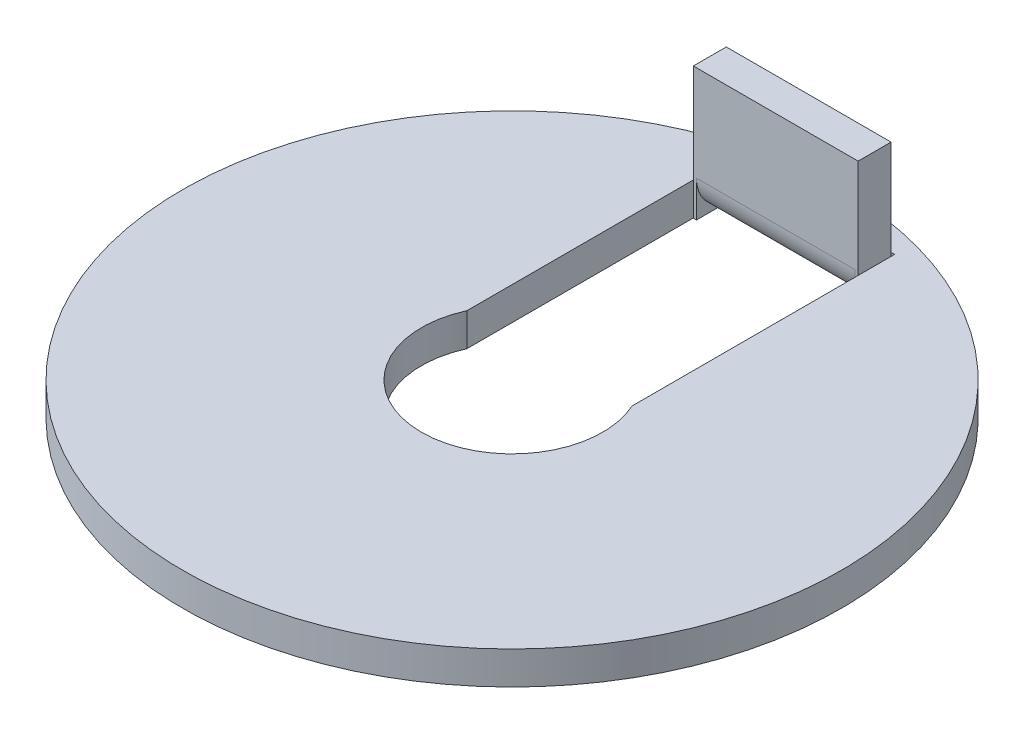
ISO-10303-21;
HEADER;
FILE_DESCRIPTION(('STEP AP214'),'2;1');
FILE_NAME('part.step','',(''),(''),'','','');
FILE_SCHEMA(('AUTOMOTIVE_DESIGN { 1 0 10303 214 1 1 1 1 }'));
ENDSEC;
DATA;
#1=APPLICATION_CONTEXT('core data for automotive mechanical design processes');
#2=APPLICATION_PROTOCOL_DEFINITION('international standard','automotive_design',2000,#1);
#3=PRODUCT_CONTEXT('',#1,'mechanical');
#4=PRODUCT('Part','Part','',(#3));
#5=PRODUCT_RELATED_PRODUCT_CATEGORY('part','',(#4));
#6=PRODUCT_DEFINITION_FORMATION('','',#4);
#7=PRODUCT_DEFINITION_CONTEXT('part definition',#1,'design');
#8=PRODUCT_DEFINITION('design','',#6,#7);
#9=PRODUCT_DEFINITION_SHAPE('','',#8);
#10=(LENGTH_UNIT() NAMED_UNIT(*) SI_UNIT(.MILLI.,.METRE.));
#11=(NAMED_UNIT(*) PLANE_ANGLE_UNIT() SI_UNIT($,.RADIAN.));
#12=(NAMED_UNIT(*) SI_UNIT($,.STERADIAN.) SOLID_ANGLE_UNIT());
#13=UNCERTAINTY_MEASURE_WITH_UNIT(LENGTH_MEASURE(1.E-05),#10,'distance_accuracy_value','');
#14=(GEOMETRIC_REPRESENTATION_CONTEXT(3) GLOBAL_UNCERTAINTY_ASSIGNED_CONTEXT((#13)) GLOBAL_UNIT_ASSIGNED_CONTEXT((#10,
#11,#12)) REPRESENTATION_CONTEXT('',''));
#15=CARTESIAN_POINT('',(0.,0.,0.));
#16=DIRECTION('',(0.,0.,1.));
#17=DIRECTION('',(1.,0.,0.));
#18=AXIS2_PLACEMENT_3D('',#15,#16,#17);
#19=CARTESIAN_POINT('',(-2.404,0.,-9.));
#20=DIRECTION('',(1.,0.,0.));
#21=DIRECTION('',(0.,1.,0.));
#22=AXIS2_PLACEMENT_3D('',#19,#20,#21);
#23=PLANE('',#22);
#24=DIRECTION('',(0.,1.,0.));
#25=VECTOR('',#24,1.);
#26=CARTESIAN_POINT('',(-2.404,0.,-9.));
#27=LINE('',#26,#25);
#28=CARTESIAN_POINT('',(-2.404,0.,-9.));
#29=VERTEX_POINT('',#28);
#30=CARTESIAN_POINT('',(-2.404,0.00455488498966742,-9.));
#31=VERTEX_POINT('',#30);
#32=EDGE_CURVE('E283',#29,#31,#27,.T.);
#33=ORIENTED_EDGE('',*,*,#32,.T.);
#34=CARTESIAN_POINT('',(-2.404,1.1,-9.1));
#35=DIRECTION('',(-1.,0.,0.));
#36=DIRECTION('',(0.,0.,1.));
#37=AXIS2_PLACEMENT_3D('',#34,#35,#36);
#38=CIRCLE('',#37,1.1);
#39=CARTESIAN_POINT('',(-2.404,1.1,-8.));
#40=VERTEX_POINT('',#39);
#41=EDGE_CURVE('E13',#31,#40,#38,.T.);
#42=ORIENTED_EDGE('',*,*,#41,.T.);
#43=DIRECTION('',(0.,-1.,0.));
#44=VECTOR('',#43,1.);
#45=CARTESIAN_POINT('',(-2.404,4.,-8.));
#46=LINE('',#45,#44);
#47=CARTESIAN_POINT('',(-2.404,0.,-8.));
#48=VERTEX_POINT('',#47);
#49=EDGE_CURVE('E295',#40,#48,#46,.T.);
#50=ORIENTED_EDGE('',*,*,#49,.T.);
#51=DIRECTION('',(0.,0.,1.));
#52=VECTOR('',#51,1.);
#53=CARTESIAN_POINT('',(-2.404,0.,-9.));
#54=LINE('',#53,#52);
#55=EDGE_CURVE('E291',#29,#48,#54,.T.);
#56=ORIENTED_EDGE('',*,*,#55,.F.);
#57=EDGE_LOOP('',(#33,#42,#50,#56));
#58=FACE_BOUND('',#57,.T.);
#59=ADVANCED_FACE('F79',(#58),#23,.T.);
#60=CARTESIAN_POINT('',(2.404,1.1,-9.));
#61=DIRECTION('',(-1.,0.,0.));
#62=DIRECTION('',(0.,0.,1.));
#63=AXIS2_PLACEMENT_3D('',#60,#61,#62);
#64=PLANE('',#63);
#65=DIRECTION('',(0.,1.,0.));
#66=VECTOR('',#65,1.);
#67=CARTESIAN_POINT('',(2.404,4.,-8.));
#68=LINE('',#67,#66);
#69=CARTESIAN_POINT('',(2.404,0.,-8.));
#70=VERTEX_POINT('',#69);
#71=CARTESIAN_POINT('',(2.404,1.1,-8.));
#72=VERTEX_POINT('',#71);
#73=EDGE_CURVE('E285',#70,#72,#68,.T.);
#74=ORIENTED_EDGE('',*,*,#73,.T.);
#75=CARTESIAN_POINT('',(2.404,1.1,-9.1));
#76=DIRECTION('',(-1.,0.,0.));
#77=DIRECTION('',(0.,0.,1.));
#78=AXIS2_PLACEMENT_3D('',#75,#76,#77);
#79=CIRCLE('',#78,1.1);
#80=CARTESIAN_POINT('',(2.404,0.00455488498966742,-9.));
#81=VERTEX_POINT('',#80);
#82=EDGE_CURVE('E270',#72,#81,#79,.F.);
#83=ORIENTED_EDGE('',*,*,#82,.T.);
#84=DIRECTION('',(0.,-1.,0.));
#85=VECTOR('',#84,1.);
#86=CARTESIAN_POINT('',(2.404,1.1,-9.));
#87=LINE('',#86,#85);
#88=CARTESIAN_POINT('',(2.404,0.,-9.));
#89=VERTEX_POINT('',#88);
#90=EDGE_CURVE('E104',#81,#89,#87,.T.);
#91=ORIENTED_EDGE('',*,*,#90,.T.);
#92=DIRECTION('',(0.,0.,1.));
#93=VECTOR('',#92,1.);
#94=CARTESIAN_POINT('',(2.404,0.,-9.));
#95=LINE('',#94,#93);
#96=EDGE_CURVE('E289',#89,#70,#95,.T.);
#97=ORIENTED_EDGE('',*,*,#96,.T.);
#98=EDGE_LOOP('',(#74,#83,#91,#97));
#99=FACE_BOUND('',#98,.T.);
#100=ADVANCED_FACE('F341',(#99),#64,.T.);
#101=CARTESIAN_POINT('',(-2.5,4.,-8.));
#102=DIRECTION('',(0.,0.,-1.));
#103=DIRECTION('',(-1.,0.,0.));
#104=AXIS2_PLACEMENT_3D('',#101,#102,#103);
#105=PLANE('',#104);
#106=ORIENTED_EDGE('',*,*,#49,.F.);
#107=DIRECTION('',(-1.,0.,0.));
#108=VECTOR('',#107,1.);
#109=CARTESIAN_POINT('',(-2.404,1.1,-8.));
#110=LINE('',#109,#108);
#111=EDGE_CURVE('E266',#40,#72,#110,.F.);
#112=ORIENTED_EDGE('',*,*,#111,.T.);
#113=ORIENTED_EDGE('',*,*,#73,.F.);
#114=DIRECTION('',(1.,0.,0.));
#115=VECTOR('',#114,1.);
#116=CARTESIAN_POINT('',(-2.5,0.,-8.));
#117=LINE('',#116,#115);
#118=CARTESIAN_POINT('',(2.5,0.,-8.));
#119=VERTEX_POINT('',#118);
#120=EDGE_CURVE('E297',#70,#119,#117,.T.);
#121=ORIENTED_EDGE('',*,*,#120,.T.);
#122=DIRECTION('',(0.,-1.,0.));
#123=VECTOR('',#122,1.);
#124=CARTESIAN_POINT('',(2.5,4.,-8.));
#125=LINE('',#124,#123);
#126=CARTESIAN_POINT('',(2.5,4.,-8.));
#127=VERTEX_POINT('',#126);
#128=EDGE_CURVE('E83',#127,#119,#125,.T.);
#129=ORIENTED_EDGE('',*,*,#128,.F.);
#130=DIRECTION('',(1.,0.,0.));
#131=VECTOR('',#130,1.);
#132=CARTESIAN_POINT('',(-2.5,4.,-8.));
#133=LINE('',#132,#131);
#134=CARTESIAN_POINT('',(-2.5,4.,-8.));
#135=VERTEX_POINT('',#134);
#136=EDGE_CURVE('E298',#135,#127,#133,.T.);
#137=ORIENTED_EDGE('',*,*,#136,.F.);
#138=DIRECTION('',(0.,-1.,0.));
#139=VECTOR('',#138,1.);
#140=CARTESIAN_POINT('',(-2.5,4.,-8.));
#141=LINE('',#140,#139);
#142=CARTESIAN_POINT('',(-2.5,0.,-8.));
#143=VERTEX_POINT('',#142);
#144=EDGE_CURVE('E310',#135,#143,#141,.T.);
#145=ORIENTED_EDGE('',*,*,#144,.T.);
#146=EDGE_CURVE('E311',#143,#48,#117,.T.);
#147=ORIENTED_EDGE('',*,*,#146,.T.);
#148=EDGE_LOOP('',(#106,#112,#113,#121,#129,#137,#145,#147));
#149=FACE_BOUND('',#148,.T.);
#150=ADVANCED_FACE('F81',(#149),#105,.F.);
#151=CARTESIAN_POINT('',(-2.5,4.,-9.));
#152=DIRECTION('',(0.,0.,-1.));
#153=DIRECTION('',(-1.,0.,0.));
#154=AXIS2_PLACEMENT_3D('',#151,#152,#153);
#155=PLANE('',#154);
#156=DIRECTION('',(-1.,0.,0.));
#157=VECTOR('',#156,1.);
#158=CARTESIAN_POINT('',(-2.404,1.1,-9.));
#159=LINE('',#158,#157);
#160=CARTESIAN_POINT('',(-2.404,1.1,-9.));
#161=VERTEX_POINT('',#160);
#162=CARTESIAN_POINT('',(2.404,1.1,-9.));
#163=VERTEX_POINT('',#162);
#164=EDGE_CURVE('E276',#161,#163,#159,.F.);
#165=ORIENTED_EDGE('',*,*,#164,.F.);
#166=EDGE_CURVE('E96',#31,#161,#27,.T.);
#167=ORIENTED_EDGE('',*,*,#166,.F.);
#168=ORIENTED_EDGE('',*,*,#32,.F.);
#169=DIRECTION('',(1.,0.,0.));
#170=VECTOR('',#169,1.);
#171=CARTESIAN_POINT('',(-2.5,0.,-9.));
#172=LINE('',#171,#170);
#173=CARTESIAN_POINT('',(-2.5,0.,-9.));
#174=VERTEX_POINT('',#173);
#175=EDGE_CURVE('E318',#174,#29,#172,.T.);
#176=ORIENTED_EDGE('',*,*,#175,.F.);
#177=DIRECTION('',(0.,-1.,0.));
#178=VECTOR('',#177,1.);
#179=CARTESIAN_POINT('',(-2.5,4.,-9.));
#180=LINE('',#179,#178);
#181=CARTESIAN_POINT('',(-2.5,4.,-9.));
#182=VERTEX_POINT('',#181);
#183=EDGE_CURVE('E324',#182,#174,#180,.T.);
#184=ORIENTED_EDGE('',*,*,#183,.F.);
#185=DIRECTION('',(1.,0.,0.));
#186=VECTOR('',#185,1.);
#187=CARTESIAN_POINT('',(-2.5,4.,-9.));
#188=LINE('',#187,#186);
#189=CARTESIAN_POINT('',(2.5,4.,-9.));
#190=VERTEX_POINT('',#189);
#191=EDGE_CURVE('E304',#182,#190,#188,.T.);
#192=ORIENTED_EDGE('',*,*,#191,.T.);
#193=DIRECTION('',(0.,-1.,0.));
#194=VECTOR('',#193,1.);
#195=CARTESIAN_POINT('',(2.5,4.,-9.));
#196=LINE('',#195,#194);
#197=CARTESIAN_POINT('',(2.5,0.,-9.));
#198=VERTEX_POINT('',#197);
#199=EDGE_CURVE('E325',#190,#198,#196,.T.);
#200=ORIENTED_EDGE('',*,*,#199,.T.);
#201=EDGE_CURVE('E317',#89,#198,#172,.T.);
#202=ORIENTED_EDGE('',*,*,#201,.F.);
#203=ORIENTED_EDGE('',*,*,#90,.F.);
#204=EDGE_CURVE('E286',#163,#81,#87,.T.);
#205=ORIENTED_EDGE('',*,*,#204,.F.);
#206=EDGE_LOOP('',(#165,#167,#168,#176,#184,#192,#200,#202,#203,#205));
#207=FACE_BOUND('',#206,.T.);
#208=ADVANCED_FACE('F339',(#207),#155,.T.);
#209=CARTESIAN_POINT('',(0.,0.,0.));
#210=DIRECTION('',(0.,-1.,0.));
#211=DIRECTION('',(-1.,0.,0.));
#212=AXIS2_PLACEMENT_3D('',#209,#210,#211);
#213=PLANE('',#212);
#214=ORIENTED_EDGE('',*,*,#175,.T.);
#215=ORIENTED_EDGE('',*,*,#55,.T.);
#216=ORIENTED_EDGE('',*,*,#146,.F.);
#217=DIRECTION('',(0.,0.,-1.));
#218=VECTOR('',#217,1.);
#219=CARTESIAN_POINT('',(-2.5,0.,-8.));
#220=LINE('',#219,#218);
#221=EDGE_CURVE('E301',#143,#174,#220,.T.);
#222=ORIENTED_EDGE('',*,*,#221,.T.);
#223=EDGE_LOOP('',(#214,#215,#216,#222));
#224=FACE_BOUND('',#223,.T.);
#225=ADVANCED_FACE('F415',(#224),#213,.T.);
#226=ORIENTED_EDGE('',*,*,#120,.F.);
#227=ORIENTED_EDGE('',*,*,#96,.F.);
#228=ORIENTED_EDGE('',*,*,#201,.T.);
#229=DIRECTION('',(0.,0.,1.));
#230=VECTOR('',#229,1.);
#231=CARTESIAN_POINT('',(2.5,0.,-9.));
#232=LINE('',#231,#230);
#233=EDGE_CURVE('E314',#198,#119,#232,.T.);
#234=ORIENTED_EDGE('',*,*,#233,.T.);
#235=EDGE_LOOP('',(#226,#227,#228,#234));
#236=FACE_BOUND('',#235,.T.);
#237=ADVANCED_FACE('F338',(#236),#213,.T.);
#238=CARTESIAN_POINT('',(2.5,4.,-9.));
#239=DIRECTION('',(1.,0.,0.));
#240=DIRECTION('',(0.,0.,-1.));
#241=AXIS2_PLACEMENT_3D('',#238,#239,#240);
#242=PLANE('',#241);
#243=ORIENTED_EDGE('',*,*,#233,.F.);
#244=ORIENTED_EDGE('',*,*,#199,.F.);
#245=DIRECTION('',(0.,0.,1.));
#246=VECTOR('',#245,1.);
#247=CARTESIAN_POINT('',(2.5,4.,-9.));
#248=LINE('',#247,#246);
#249=EDGE_CURVE('E300',#190,#127,#248,.T.);
#250=ORIENTED_EDGE('',*,*,#249,.T.);
#251=ORIENTED_EDGE('',*,*,#128,.T.);
#252=EDGE_LOOP('',(#243,#244,#250,#251));
#253=FACE_BOUND('',#252,.T.);
#254=ADVANCED_FACE('F332',(#253),#242,.T.);
#255=CARTESIAN_POINT('',(-2.5,4.,-8.));
#256=DIRECTION('',(-1.,0.,0.));
#257=DIRECTION('',(0.,0.,1.));
#258=AXIS2_PLACEMENT_3D('',#255,#256,#257);
#259=PLANE('',#258);
#260=ORIENTED_EDGE('',*,*,#221,.F.);
#261=ORIENTED_EDGE('',*,*,#144,.F.);
#262=DIRECTION('',(0.,0.,-1.));
#263=VECTOR('',#262,1.);
#264=CARTESIAN_POINT('',(-2.5,4.,-8.));
#265=LINE('',#264,#263);
#266=EDGE_CURVE('E307',#135,#182,#265,.T.);
#267=ORIENTED_EDGE('',*,*,#266,.T.);
#268=ORIENTED_EDGE('',*,*,#183,.T.);
#269=EDGE_LOOP('',(#260,#261,#267,#268));
#270=FACE_BOUND('',#269,.T.);
#271=ADVANCED_FACE('F413',(#270),#259,.T.);
#272=CARTESIAN_POINT('',(0.,4.,0.));
#273=DIRECTION('',(0.,-1.,0.));
#274=DIRECTION('',(-1.,0.,0.));
#275=AXIS2_PLACEMENT_3D('',#272,#273,#274);
#276=PLANE('',#275);
#277=ORIENTED_EDGE('',*,*,#136,.T.);
#278=ORIENTED_EDGE('',*,*,#249,.F.);
#279=ORIENTED_EDGE('',*,*,#191,.F.);
#280=ORIENTED_EDGE('',*,*,#266,.F.);
#281=EDGE_LOOP('',(#277,#278,#279,#280));
#282=FACE_BOUND('',#281,.T.);
#283=ADVANCED_FACE('F410',(#282),#276,.F.);
#284=CARTESIAN_POINT('',(2.404,1.1,-9.1));
#285=DIRECTION('',(1.,0.,0.));
#286=DIRECTION('',(0.,0.,-1.));
#287=AXIS2_PLACEMENT_3D('',#284,#285,#286);
#288=PLANE('',#287);
#289=CARTESIAN_POINT('',(2.404,1.1,-9.1));
#290=DIRECTION('',(-1.,0.,0.));
#291=DIRECTION('',(0.,0.,1.));
#292=AXIS2_PLACEMENT_3D('',#289,#290,#291);
#293=CIRCLE('',#292,0.1);
#294=CARTESIAN_POINT('',(2.404,1.,-9.1));
#295=VERTEX_POINT('',#294);
#296=EDGE_CURVE('E273',#163,#295,#293,.F.);
#297=ORIENTED_EDGE('',*,*,#296,.F.);
#298=ORIENTED_EDGE('',*,*,#204,.T.);
#299=CARTESIAN_POINT('',(2.404,0.,-9.1));
#300=VERTEX_POINT('',#299);
#301=EDGE_CURVE('E269',#81,#300,#79,.F.);
#302=ORIENTED_EDGE('',*,*,#301,.T.);
#303=DIRECTION('',(0.,-1.,0.));
#304=VECTOR('',#303,1.);
#305=CARTESIAN_POINT('',(2.404,0.,-9.1));
#306=LINE('',#305,#304);
#307=EDGE_CURVE('E263',#295,#300,#306,.T.);
#308=ORIENTED_EDGE('',*,*,#307,.F.);
#309=EDGE_LOOP('',(#297,#298,#302,#308));
#310=FACE_BOUND('',#309,.T.);
#311=ADVANCED_FACE('F348',(#310),#288,.T.);
#312=CARTESIAN_POINT('',(-2.404,1.1,-9.1));
#313=DIRECTION('',(1.,0.,0.));
#314=DIRECTION('',(0.,0.,-1.));
#315=AXIS2_PLACEMENT_3D('',#312,#313,#314);
#316=PLANE('',#315);
#317=CARTESIAN_POINT('',(-2.404,0.,-9.1));
#318=VERTEX_POINT('',#317);
#319=EDGE_CURVE('E89',#318,#31,#38,.T.);
#320=ORIENTED_EDGE('',*,*,#319,.T.);
#321=ORIENTED_EDGE('',*,*,#166,.T.);
#322=CARTESIAN_POINT('',(-2.404,1.1,-9.1));
#323=DIRECTION('',(-1.,0.,0.));
#324=DIRECTION('',(0.,0.,1.));
#325=AXIS2_PLACEMENT_3D('',#322,#323,#324);
#326=CIRCLE('',#325,0.1);
#327=CARTESIAN_POINT('',(-2.404,1.,-9.1));
#328=VERTEX_POINT('',#327);
#329=EDGE_CURVE('E279',#328,#161,#326,.T.);
#330=ORIENTED_EDGE('',*,*,#329,.F.);
#331=DIRECTION('',(0.,-1.,0.));
#332=VECTOR('',#331,1.);
#333=CARTESIAN_POINT('',(-2.404,1.,-9.1));
#334=LINE('',#333,#332);
#335=EDGE_CURVE('E258',#328,#318,#334,.T.);
#336=ORIENTED_EDGE('',*,*,#335,.T.);
#337=EDGE_LOOP('',(#320,#321,#330,#336));
#338=FACE_BOUND('',#337,.T.);
#339=ADVANCED_FACE('F387',(#338),#316,.F.);
#340=CARTESIAN_POINT('',(-2.404,1.1,-9.1));
#341=DIRECTION('',(-1.,0.,0.));
#342=DIRECTION('',(0.,-1.,0.));
#343=AXIS2_PLACEMENT_3D('',#340,#341,#342);
#344=CYLINDRICAL_SURFACE('',#343,1.1);
#345=ORIENTED_EDGE('',*,*,#111,.F.);
#346=ORIENTED_EDGE('',*,*,#41,.F.);
#347=ORIENTED_EDGE('',*,*,#319,.F.);
#348=DIRECTION('',(-1.,0.,0.));
#349=VECTOR('',#348,1.);
#350=CARTESIAN_POINT('',(0.,0.,-9.1));
#351=LINE('',#350,#349);
#352=EDGE_CURVE('E256',#300,#318,#351,.T.);
#353=ORIENTED_EDGE('',*,*,#352,.F.);
#354=ORIENTED_EDGE('',*,*,#301,.F.);
#355=ORIENTED_EDGE('',*,*,#82,.F.);
#356=EDGE_LOOP('',(#345,#346,#347,#353,#354,#355));
#357=FACE_BOUND('',#356,.T.);
#358=ADVANCED_FACE('F350',(#357),#344,.T.);
#359=CARTESIAN_POINT('',(-2.404,1.1,-9.1));
#360=DIRECTION('',(-1.,0.,0.));
#361=DIRECTION('',(0.,-1.,0.));
#362=AXIS2_PLACEMENT_3D('',#359,#360,#361);
#363=CYLINDRICAL_SURFACE('',#362,0.1);
#364=ORIENTED_EDGE('',*,*,#164,.T.);
#365=ORIENTED_EDGE('',*,*,#296,.T.);
#366=DIRECTION('',(1.,0.,0.));
#367=VECTOR('',#366,1.);
#368=CARTESIAN_POINT('',(2.404,1.,-9.1));
#369=LINE('',#368,#367);
#370=EDGE_CURVE('E261',#295,#328,#369,.F.);
#371=ORIENTED_EDGE('',*,*,#370,.T.);
#372=ORIENTED_EDGE('',*,*,#329,.T.);
#373=EDGE_LOOP('',(#364,#365,#371,#372));
#374=FACE_BOUND('',#373,.T.);
#375=ADVANCED_FACE('F384',(#374),#363,.F.);
#376=CARTESIAN_POINT('',(0.,0.,0.));
#377=DIRECTION('',(0.,-1.,0.));
#378=DIRECTION('',(0.,0.,-1.));
#379=AXIS2_PLACEMENT_3D('',#376,#377,#378);
#380=PLANE('',#379);
#381=CARTESIAN_POINT('',(0.,0.,0.));
#382=DIRECTION('',(0.,-1.,0.));
#383=DIRECTION('',(0.,0.,-1.));
#384=AXIS2_PLACEMENT_3D('',#381,#382,#383);
#385=CIRCLE('',#384,10.);
#386=CARTESIAN_POINT('',(0.,0.,-10.));
#387=VERTEX_POINT('',#386);
#388=EDGE_CURVE('E282',#387,#387,#385,.T.);
#389=ORIENTED_EDGE('',*,*,#388,.T.);
#390=EDGE_LOOP('',(#389));
#391=FACE_BOUND('',#390,.T.);
#392=DIRECTION('',(0.,0.,-1.));
#393=VECTOR('',#392,1.);
#394=CARTESIAN_POINT('',(2.404,0.,-9.));
#395=LINE('',#394,#393);
#396=CARTESIAN_POINT('',(2.404,0.,-9.101));
#397=VERTEX_POINT('',#396);
#398=EDGE_CURVE('E236',#300,#397,#395,.T.);
#399=ORIENTED_EDGE('',*,*,#398,.F.);
#400=ORIENTED_EDGE('',*,*,#352,.T.);
#401=DIRECTION('',(0.,0.,1.));
#402=VECTOR('',#401,1.);
#403=CARTESIAN_POINT('',(-2.404,0.,-9.));
#404=LINE('',#403,#402);
#405=CARTESIAN_POINT('',(-2.404,0.,-9.101));
#406=VERTEX_POINT('',#405);
#407=EDGE_CURVE('E227',#406,#318,#404,.T.);
#408=ORIENTED_EDGE('',*,*,#407,.F.);
#409=DIRECTION('',(1.,0.,0.));
#410=VECTOR('',#409,1.);
#411=CARTESIAN_POINT('',(-2.404,0.,-9.101));
#412=LINE('',#411,#410);
#413=CARTESIAN_POINT('',(-2.505,0.,-9.101));
#414=VERTEX_POINT('',#413);
#415=EDGE_CURVE('E204',#414,#406,#412,.T.);
#416=ORIENTED_EDGE('',*,*,#415,.F.);
#417=DIRECTION('',(0.,0.,-1.));
#418=VECTOR('',#417,1.);
#419=CARTESIAN_POINT('',(-2.505,0.,-1.13466955542131));
#420=LINE('',#419,#418);
#421=CARTESIAN_POINT('',(-2.505,0.,-1.13466955542131));
#422=VERTEX_POINT('',#421);
#423=EDGE_CURVE('E216',#422,#414,#420,.T.);
#424=ORIENTED_EDGE('',*,*,#423,.F.);
#425=CARTESIAN_POINT('',(0.,0.,0.));
#426=DIRECTION('',(0.,-1.,0.));
#427=DIRECTION('',(0.,0.,-1.));
#428=AXIS2_PLACEMENT_3D('',#425,#426,#427);
#429=CIRCLE('',#428,2.75);
#430=CARTESIAN_POINT('',(2.505,0.,-1.13466955542131));
#431=VERTEX_POINT('',#430);
#432=EDGE_CURVE('E220',#431,#422,#429,.T.);
#433=ORIENTED_EDGE('',*,*,#432,.F.);
#434=DIRECTION('',(0.,0.,1.));
#435=VECTOR('',#434,1.);
#436=CARTESIAN_POINT('',(2.505,0.,-9.101));
#437=LINE('',#436,#435);
#438=CARTESIAN_POINT('',(2.505,0.,-9.101));
#439=VERTEX_POINT('',#438);
#440=EDGE_CURVE('E232',#439,#431,#437,.T.);
#441=ORIENTED_EDGE('',*,*,#440,.F.);
#442=DIRECTION('',(1.,0.,0.));
#443=VECTOR('',#442,1.);
#444=CARTESIAN_POINT('',(2.404,0.,-9.101));
#445=LINE('',#444,#443);
#446=EDGE_CURVE('E234',#397,#439,#445,.T.);
#447=ORIENTED_EDGE('',*,*,#446,.F.);
#448=EDGE_LOOP('',(#399,#400,#408,#416,#424,#433,#441,#447));
#449=FACE_BOUND('',#448,.T.);
#450=ADVANCED_FACE('F224',(#391,#449),#380,.T.);
#451=CARTESIAN_POINT('',(0.,1.00000000000003,0.));
#452=DIRECTION('',(0.,-1.,0.));
#453=DIRECTION('',(0.,0.,-1.));
#454=AXIS2_PLACEMENT_3D('',#451,#452,#453);
#455=PLANE('',#454);
#456=CARTESIAN_POINT('',(0.,1.00000000000003,0.));
#457=DIRECTION('',(0.,-1.,0.));
#458=DIRECTION('',(0.,0.,-1.));
#459=AXIS2_PLACEMENT_3D('',#456,#457,#458);
#460=CIRCLE('',#459,10.);
#461=CARTESIAN_POINT('',(0.,0.999999999999997,-10.));
#462=VERTEX_POINT('',#461);
#463=EDGE_CURVE('E371',#462,#462,#460,.T.);
#464=ORIENTED_EDGE('',*,*,#463,.F.);
#465=EDGE_LOOP('',(#464));
#466=FACE_BOUND('',#465,.T.);
#467=ORIENTED_EDGE('',*,*,#370,.F.);
#468=DIRECTION('',(0.,0.,1.));
#469=VECTOR('',#468,1.);
#470=CARTESIAN_POINT('',(2.40400000000004,1.00000000000003,0.));
#471=LINE('',#470,#469);
#472=CARTESIAN_POINT('',(2.404,1.,-9.101));
#473=VERTEX_POINT('',#472);
#474=EDGE_CURVE('E251',#295,#473,#471,.F.);
#475=ORIENTED_EDGE('',*,*,#474,.T.);
#476=DIRECTION('',(-1.,0.,0.));
#477=VECTOR('',#476,1.);
#478=CARTESIAN_POINT('',(0.,1.,-9.101));
#479=LINE('',#478,#477);
#480=CARTESIAN_POINT('',(2.505,1.,-9.101));
#481=VERTEX_POINT('',#480);
#482=EDGE_CURVE('E248',#473,#481,#479,.F.);
#483=ORIENTED_EDGE('',*,*,#482,.T.);
#484=DIRECTION('',(0.,0.,-1.));
#485=VECTOR('',#484,1.);
#486=CARTESIAN_POINT('',(2.505,1.00000000000003,0.));
#487=LINE('',#486,#485);
#488=CARTESIAN_POINT('',(2.505,1.00000000000003,-1.13466955542131));
#489=VERTEX_POINT('',#488);
#490=EDGE_CURVE('E245',#481,#489,#487,.F.);
#491=ORIENTED_EDGE('',*,*,#490,.T.);
#492=CARTESIAN_POINT('',(0.,1.00000000000003,0.));
#493=DIRECTION('',(0.,-1.,0.));
#494=DIRECTION('',(0.,0.,-1.));
#495=AXIS2_PLACEMENT_3D('',#492,#493,#494);
#496=CIRCLE('',#495,2.75);
#497=CARTESIAN_POINT('',(-2.505,1.00000000000003,-1.13466955542131));
#498=VERTEX_POINT('',#497);
#499=EDGE_CURVE('E242',#489,#498,#496,.T.);
#500=ORIENTED_EDGE('',*,*,#499,.T.);
#501=DIRECTION('',(0.,0.,1.));
#502=VECTOR('',#501,1.);
#503=CARTESIAN_POINT('',(-2.505,1.00000000000003,0.));
#504=LINE('',#503,#502);
#505=CARTESIAN_POINT('',(-2.505,1.,-9.101));
#506=VERTEX_POINT('',#505);
#507=EDGE_CURVE('E240',#498,#506,#504,.F.);
#508=ORIENTED_EDGE('',*,*,#507,.T.);
#509=DIRECTION('',(-1.,0.,0.));
#510=VECTOR('',#509,1.);
#511=CARTESIAN_POINT('',(0.,1.,-9.101));
#512=LINE('',#511,#510);
#513=CARTESIAN_POINT('',(-2.404,1.,-9.101));
#514=VERTEX_POINT('',#513);
#515=EDGE_CURVE('E207',#506,#514,#512,.F.);
#516=ORIENTED_EDGE('',*,*,#515,.T.);
#517=DIRECTION('',(0.,0.,-1.));
#518=VECTOR('',#517,1.);
#519=CARTESIAN_POINT('',(-2.40400000000004,1.00000000000003,0.));
#520=LINE('',#519,#518);
#521=EDGE_CURVE('E253',#514,#328,#520,.F.);
#522=ORIENTED_EDGE('',*,*,#521,.T.);
#523=EDGE_LOOP('',(#467,#475,#483,#491,#500,#508,#516,#522));
#524=FACE_BOUND('',#523,.T.);
#525=ADVANCED_FACE('F381',(#466,#524),#455,.F.);
#526=CARTESIAN_POINT('',(-2.404,0.,-9.));
#527=DIRECTION('',(-1.,0.,0.));
#528=DIRECTION('',(0.,0.,1.));
#529=AXIS2_PLACEMENT_3D('',#526,#527,#528);
#530=PLANE('',#529);
#531=ORIENTED_EDGE('',*,*,#407,.T.);
#532=ORIENTED_EDGE('',*,*,#335,.F.);
#533=ORIENTED_EDGE('',*,*,#521,.F.);
#534=DIRECTION('',(0.,-1.,0.));
#535=VECTOR('',#534,1.);
#536=CARTESIAN_POINT('',(-2.404,0.,-9.101));
#537=LINE('',#536,#535);
#538=EDGE_CURVE('E212',#406,#514,#537,.F.);
#539=ORIENTED_EDGE('',*,*,#538,.F.);
#540=EDGE_LOOP('',(#531,#532,#533,#539));
#541=FACE_BOUND('',#540,.T.);
#542=ADVANCED_FACE('F389',(#541),#530,.T.);
#543=CARTESIAN_POINT('',(2.404,0.,-9.));
#544=DIRECTION('',(1.,0.,0.));
#545=DIRECTION('',(0.,0.,-1.));
#546=AXIS2_PLACEMENT_3D('',#543,#544,#545);
#547=PLANE('',#546);
#548=ORIENTED_EDGE('',*,*,#474,.F.);
#549=ORIENTED_EDGE('',*,*,#307,.T.);
#550=ORIENTED_EDGE('',*,*,#398,.T.);
#551=DIRECTION('',(0.,-1.,0.));
#552=VECTOR('',#551,1.);
#553=CARTESIAN_POINT('',(2.404,0.,-9.101));
#554=LINE('',#553,#552);
#555=EDGE_CURVE('E365',#397,#473,#554,.F.);
#556=ORIENTED_EDGE('',*,*,#555,.T.);
#557=EDGE_LOOP('',(#548,#549,#550,#556));
#558=FACE_BOUND('',#557,.T.);
#559=ADVANCED_FACE('F354',(#558),#547,.T.);
#560=CARTESIAN_POINT('',(0.,0.,0.));
#561=DIRECTION('',(0.,1.,0.));
#562=DIRECTION('',(0.,0.,1.));
#563=AXIS2_PLACEMENT_3D('',#560,#561,#562);
#564=CYLINDRICAL_SURFACE('',#563,10.);
#565=ORIENTED_EDGE('',*,*,#388,.F.);
#566=EDGE_LOOP('',(#565));
#567=FACE_BOUND('',#566,.T.);
#568=ORIENTED_EDGE('',*,*,#463,.T.);
#569=EDGE_LOOP('',(#568));
#570=FACE_BOUND('',#569,.T.);
#571=ADVANCED_FACE('F396',(#567,#570),#564,.T.);
#572=CARTESIAN_POINT('',(2.404,0.,-9.101));
#573=DIRECTION('',(0.,0.,1.));
#574=DIRECTION('',(0.,-1.,0.));
#575=AXIS2_PLACEMENT_3D('',#572,#573,#574);
#576=PLANE('',#575);
#577=ORIENTED_EDGE('',*,*,#482,.F.);
#578=ORIENTED_EDGE('',*,*,#555,.F.);
#579=ORIENTED_EDGE('',*,*,#446,.T.);
#580=DIRECTION('',(0.,-1.,0.));
#581=VECTOR('',#580,1.);
#582=CARTESIAN_POINT('',(2.505,0.,-9.101));
#583=LINE('',#582,#581);
#584=EDGE_CURVE('E363',#439,#481,#583,.F.);
#585=ORIENTED_EDGE('',*,*,#584,.T.);
#586=EDGE_LOOP('',(#577,#578,#579,#585));
#587=FACE_BOUND('',#586,.T.);
#588=ADVANCED_FACE('F362',(#587),#576,.T.);
#589=CARTESIAN_POINT('',(2.505,0.,-9.101));
#590=DIRECTION('',(-1.,0.,0.));
#591=DIRECTION('',(0.,0.,1.));
#592=AXIS2_PLACEMENT_3D('',#589,#590,#591);
#593=PLANE('',#592);
#594=ORIENTED_EDGE('',*,*,#490,.F.);
#595=ORIENTED_EDGE('',*,*,#584,.F.);
#596=ORIENTED_EDGE('',*,*,#440,.T.);
#597=DIRECTION('',(0.,1.,0.));
#598=VECTOR('',#597,1.);
#599=CARTESIAN_POINT('',(2.505,0.,-1.13466955542131));
#600=LINE('',#599,#598);
#601=EDGE_CURVE('E369',#431,#489,#600,.T.);
#602=ORIENTED_EDGE('',*,*,#601,.T.);
#603=EDGE_LOOP('',(#594,#595,#596,#602));
#604=FACE_BOUND('',#603,.T.);
#605=ADVANCED_FACE('F367',(#604),#593,.T.);
#606=CARTESIAN_POINT('',(0.,0.,0.));
#607=DIRECTION('',(0.,1.,0.));
#608=DIRECTION('',(0.,0.,1.));
#609=AXIS2_PLACEMENT_3D('',#606,#607,#608);
#610=CYLINDRICAL_SURFACE('',#609,2.75);
#611=ORIENTED_EDGE('',*,*,#499,.F.);
#612=ORIENTED_EDGE('',*,*,#601,.F.);
#613=ORIENTED_EDGE('',*,*,#432,.T.);
#614=DIRECTION('',(0.,1.,0.));
#615=VECTOR('',#614,1.);
#616=CARTESIAN_POINT('',(-2.505,0.,-1.13466955542131));
#617=LINE('',#616,#615);
#618=EDGE_CURVE('E211',#422,#498,#617,.T.);
#619=ORIENTED_EDGE('',*,*,#618,.T.);
#620=EDGE_LOOP('',(#611,#612,#613,#619));
#621=FACE_BOUND('',#620,.T.);
#622=ADVANCED_FACE('F378',(#621),#610,.F.);
#623=CARTESIAN_POINT('',(-2.505,0.,-1.13466955542131));
#624=DIRECTION('',(1.,0.,0.));
#625=DIRECTION('',(0.,0.,-1.));
#626=AXIS2_PLACEMENT_3D('',#623,#624,#625);
#627=PLANE('',#626);
#628=ORIENTED_EDGE('',*,*,#507,.F.);
#629=ORIENTED_EDGE('',*,*,#618,.F.);
#630=ORIENTED_EDGE('',*,*,#423,.T.);
#631=DIRECTION('',(0.,-1.,0.));
#632=VECTOR('',#631,1.);
#633=CARTESIAN_POINT('',(-2.505,0.,-9.101));
#634=LINE('',#633,#632);
#635=EDGE_CURVE('E199',#414,#506,#634,.F.);
#636=ORIENTED_EDGE('',*,*,#635,.T.);
#637=EDGE_LOOP('',(#628,#629,#630,#636));
#638=FACE_BOUND('',#637,.T.);
#639=ADVANCED_FACE('F217',(#638),#627,.T.);
#640=CARTESIAN_POINT('',(-2.404,0.,-9.101));
#641=DIRECTION('',(0.,0.,1.));
#642=DIRECTION('',(0.,-1.,0.));
#643=AXIS2_PLACEMENT_3D('',#640,#641,#642);
#644=PLANE('',#643);
#645=ORIENTED_EDGE('',*,*,#515,.F.);
#646=ORIENTED_EDGE('',*,*,#635,.F.);
#647=ORIENTED_EDGE('',*,*,#415,.T.);
#648=ORIENTED_EDGE('',*,*,#538,.T.);
#649=EDGE_LOOP('',(#645,#646,#647,#648));
#650=FACE_BOUND('',#649,.T.);
#651=ADVANCED_FACE('F201',(#650),#644,.T.);
#652=CLOSED_SHELL('',(#59,#100,#150,#208,#225,#237,#254,#271,#283,#311,#339,#358,#375,#450,#525,
#542,#559,#571,#588,#605,#622,#639,#651));
#653=MANIFOLD_SOLID_BREP('B2',#652);
#654=ADVANCED_BREP_SHAPE_REPRESENTATION('',(#18,#653),#14);
#655=SHAPE_DEFINITION_REPRESENTATION(#9,#654);
ENDSEC;
END-ISO-10303-21;
